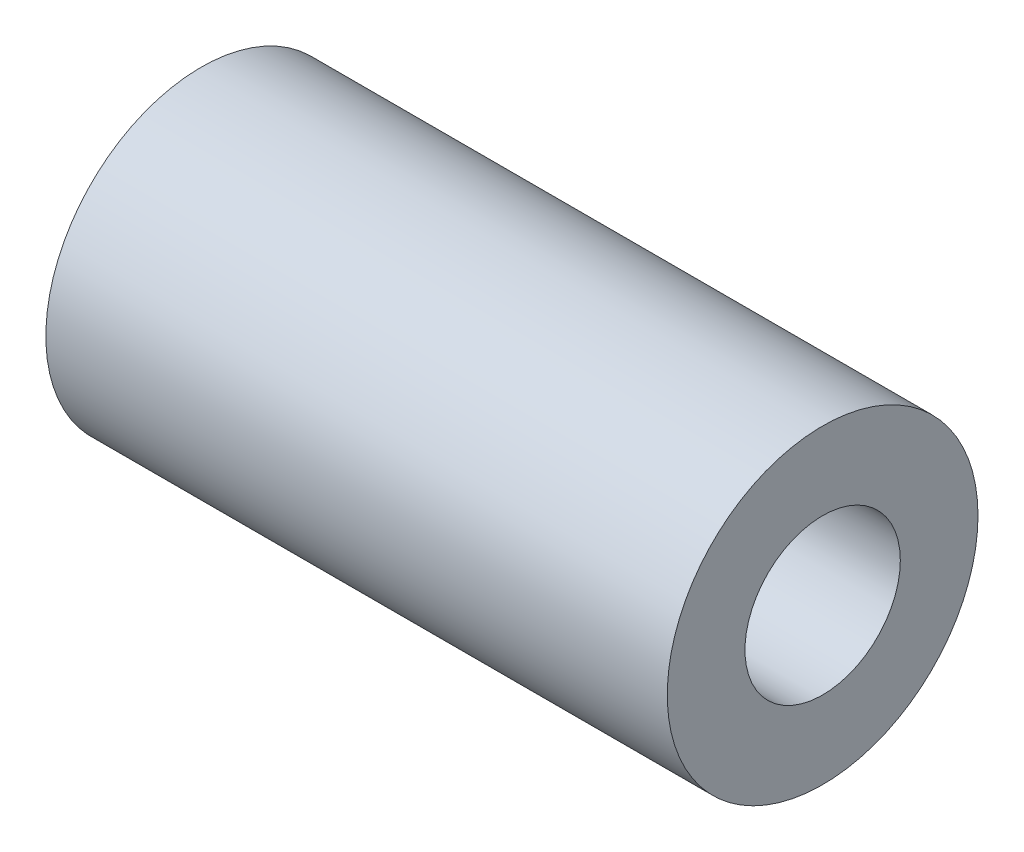
ISO-10303-21;
HEADER;
FILE_DESCRIPTION(('STEP AP214'),'2;1');
FILE_NAME('part.step','',(''),(''),'','','');
FILE_SCHEMA(('AUTOMOTIVE_DESIGN { 1 0 10303 214 1 1 1 1 }'));
ENDSEC;
DATA;
#1=APPLICATION_CONTEXT('core data for automotive mechanical design processes');
#2=APPLICATION_PROTOCOL_DEFINITION('international standard','automotive_design',2000,#1);
#3=PRODUCT_CONTEXT('',#1,'mechanical');
#4=PRODUCT('Part','Part','',(#3));
#5=PRODUCT_RELATED_PRODUCT_CATEGORY('part','',(#4));
#6=PRODUCT_DEFINITION_FORMATION('','',#4);
#7=PRODUCT_DEFINITION_CONTEXT('part definition',#1,'design');
#8=PRODUCT_DEFINITION('design','',#6,#7);
#9=PRODUCT_DEFINITION_SHAPE('','',#8);
#10=(LENGTH_UNIT() NAMED_UNIT(*) SI_UNIT(.MILLI.,.METRE.));
#11=(NAMED_UNIT(*) PLANE_ANGLE_UNIT() SI_UNIT($,.RADIAN.));
#12=(NAMED_UNIT(*) SI_UNIT($,.STERADIAN.) SOLID_ANGLE_UNIT());
#13=UNCERTAINTY_MEASURE_WITH_UNIT(LENGTH_MEASURE(1.E-05),#10,'distance_accuracy_value','');
#14=(GEOMETRIC_REPRESENTATION_CONTEXT(3) GLOBAL_UNCERTAINTY_ASSIGNED_CONTEXT((#13)) GLOBAL_UNIT_ASSIGNED_CONTEXT((#10,
#11,#12)) REPRESENTATION_CONTEXT('',''));
#15=CARTESIAN_POINT('',(0.,0.,0.));
#16=DIRECTION('',(0.,0.,1.));
#17=DIRECTION('',(1.,0.,0.));
#18=AXIS2_PLACEMENT_3D('',#15,#16,#17);
#19=CARTESIAN_POINT('',(20.,0.,0.));
#20=DIRECTION('',(1.,0.,0.));
#21=DIRECTION('',(0.,0.,-1.));
#22=AXIS2_PLACEMENT_3D('',#19,#20,#21);
#23=PLANE('',#22);
#24=CARTESIAN_POINT('',(20.,0.,0.));
#25=DIRECTION('',(1.,0.,0.));
#26=DIRECTION('',(0.,0.,-1.));
#27=AXIS2_PLACEMENT_3D('',#24,#25,#26);
#28=CIRCLE('',#27,5.);
#29=CARTESIAN_POINT('',(20.,0.,-5.));
#30=VERTEX_POINT('',#29);
#31=EDGE_CURVE('E10',#30,#30,#28,.T.);
#32=ORIENTED_EDGE('',*,*,#31,.T.);
#33=EDGE_LOOP('',(#32));
#34=FACE_BOUND('',#33,.T.);
#35=CARTESIAN_POINT('',(20.,0.,0.));
#36=DIRECTION('',(1.,0.,0.));
#37=DIRECTION('',(0.,0.,-1.));
#38=AXIS2_PLACEMENT_3D('',#35,#36,#37);
#39=CIRCLE('',#38,2.5);
#40=CARTESIAN_POINT('',(20.,0.,-2.5));
#41=VERTEX_POINT('',#40);
#42=EDGE_CURVE('E41',#41,#41,#39,.T.);
#43=ORIENTED_EDGE('',*,*,#42,.F.);
#44=EDGE_LOOP('',(#43));
#45=FACE_BOUND('',#44,.T.);
#46=ADVANCED_FACE('F30',(#34,#45),#23,.T.);
#47=CARTESIAN_POINT('',(0.,0.,0.));
#48=DIRECTION('',(1.,0.,0.));
#49=DIRECTION('',(0.,0.,-1.));
#50=AXIS2_PLACEMENT_3D('',#47,#48,#49);
#51=PLANE('',#50);
#52=CARTESIAN_POINT('',(0.,0.,0.));
#53=DIRECTION('',(1.,0.,0.));
#54=DIRECTION('',(0.,0.,-1.));
#55=AXIS2_PLACEMENT_3D('',#52,#53,#54);
#56=CIRCLE('',#55,5.);
#57=CARTESIAN_POINT('',(0.,0.,-5.));
#58=VERTEX_POINT('',#57);
#59=EDGE_CURVE('E34',#58,#58,#56,.T.);
#60=ORIENTED_EDGE('',*,*,#59,.F.);
#61=EDGE_LOOP('',(#60));
#62=FACE_BOUND('',#61,.T.);
#63=CARTESIAN_POINT('',(0.,0.,0.));
#64=DIRECTION('',(1.,0.,0.));
#65=DIRECTION('',(0.,0.,-1.));
#66=AXIS2_PLACEMENT_3D('',#63,#64,#65);
#67=CIRCLE('',#66,2.5);
#68=CARTESIAN_POINT('',(0.,0.,-2.5));
#69=VERTEX_POINT('',#68);
#70=EDGE_CURVE('E43',#69,#69,#67,.T.);
#71=ORIENTED_EDGE('',*,*,#70,.T.);
#72=EDGE_LOOP('',(#71));
#73=FACE_BOUND('',#72,.T.);
#74=ADVANCED_FACE('F53',(#62,#73),#51,.F.);
#75=CARTESIAN_POINT('',(20.,0.,0.));
#76=DIRECTION('',(-1.,0.,0.));
#77=DIRECTION('',(0.,0.,1.));
#78=AXIS2_PLACEMENT_3D('',#75,#76,#77);
#79=CYLINDRICAL_SURFACE('',#78,5.);
#80=ORIENTED_EDGE('',*,*,#31,.F.);
#81=EDGE_LOOP('',(#80));
#82=FACE_BOUND('',#81,.T.);
#83=ORIENTED_EDGE('',*,*,#59,.T.);
#84=EDGE_LOOP('',(#83));
#85=FACE_BOUND('',#84,.T.);
#86=ADVANCED_FACE('F32',(#82,#85),#79,.T.);
#87=CARTESIAN_POINT('',(20.,0.,0.));
#88=DIRECTION('',(-1.,0.,0.));
#89=DIRECTION('',(0.,0.,1.));
#90=AXIS2_PLACEMENT_3D('',#87,#88,#89);
#91=CYLINDRICAL_SURFACE('',#90,2.5);
#92=ORIENTED_EDGE('',*,*,#42,.T.);
#93=EDGE_LOOP('',(#92));
#94=FACE_BOUND('',#93,.T.);
#95=ORIENTED_EDGE('',*,*,#70,.F.);
#96=EDGE_LOOP('',(#95));
#97=FACE_BOUND('',#96,.T.);
#98=ADVANCED_FACE('F49',(#94,#97),#91,.F.);
#99=CLOSED_SHELL('',(#46,#74,#86,#98));
#100=MANIFOLD_SOLID_BREP('B2',#99);
#101=ADVANCED_BREP_SHAPE_REPRESENTATION('',(#18,#100),#14);
#102=SHAPE_DEFINITION_REPRESENTATION(#9,#101);
ENDSEC;
END-ISO-10303-21;
